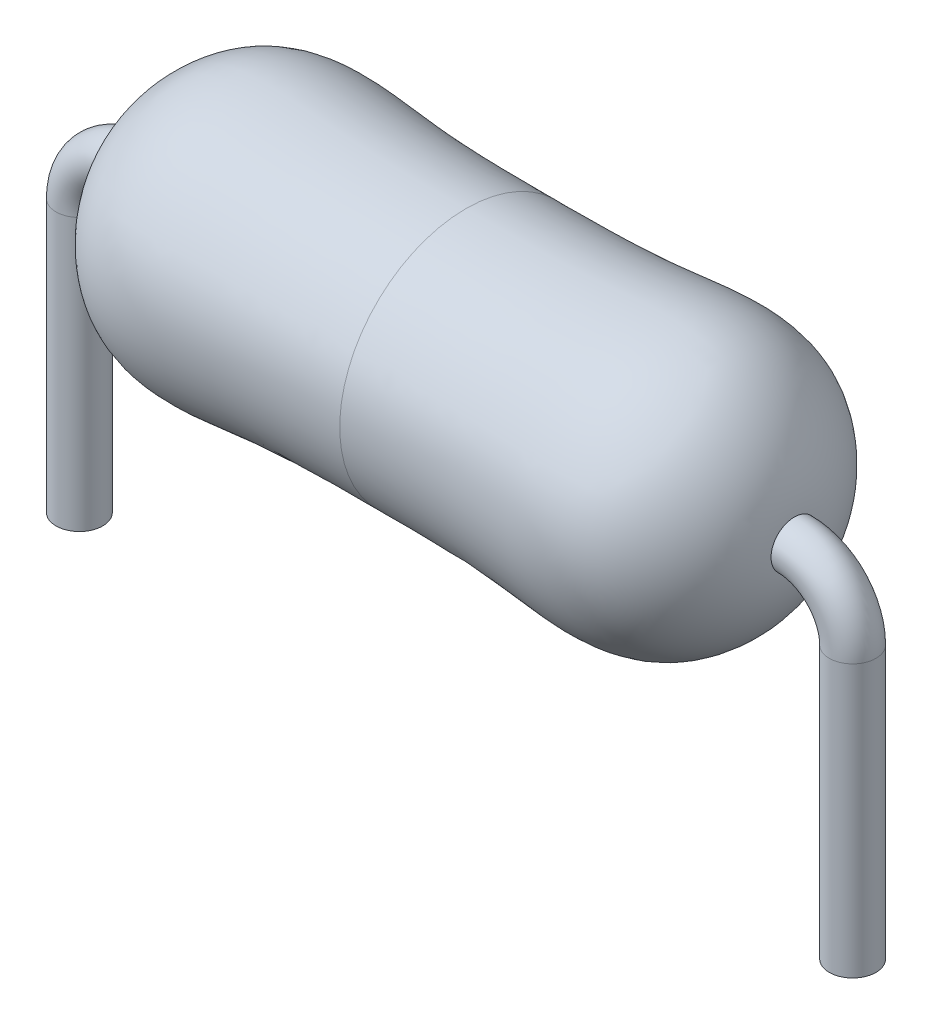
ISO-10303-21;
HEADER;
FILE_DESCRIPTION(('STEP AP214'),'2;1');
FILE_NAME('part.step','',(''),(''),'','','');
FILE_SCHEMA(('AUTOMOTIVE_DESIGN { 1 0 10303 214 1 1 1 1 }'));
ENDSEC;
DATA;
#1=APPLICATION_CONTEXT('core data for automotive mechanical design processes');
#2=APPLICATION_PROTOCOL_DEFINITION('international standard','automotive_design',2000,#1);
#3=PRODUCT_CONTEXT('',#1,'mechanical');
#4=PRODUCT('Part','Part','',(#3));
#5=PRODUCT_RELATED_PRODUCT_CATEGORY('part','',(#4));
#6=PRODUCT_DEFINITION_FORMATION('','',#4);
#7=PRODUCT_DEFINITION_CONTEXT('part definition',#1,'design');
#8=PRODUCT_DEFINITION('design','',#6,#7);
#9=PRODUCT_DEFINITION_SHAPE('','',#8);
#10=(LENGTH_UNIT() NAMED_UNIT(*) SI_UNIT(.MILLI.,.METRE.));
#11=(NAMED_UNIT(*) PLANE_ANGLE_UNIT() SI_UNIT($,.RADIAN.));
#12=(NAMED_UNIT(*) SI_UNIT($,.STERADIAN.) SOLID_ANGLE_UNIT());
#13=UNCERTAINTY_MEASURE_WITH_UNIT(LENGTH_MEASURE(1.E-05),#10,'distance_accuracy_value','');
#14=(GEOMETRIC_REPRESENTATION_CONTEXT(3) GLOBAL_UNCERTAINTY_ASSIGNED_CONTEXT((#13)) GLOBAL_UNIT_ASSIGNED_CONTEXT((#10,
#11,#12)) REPRESENTATION_CONTEXT('',''));
#15=CARTESIAN_POINT('',(0.,0.,0.));
#16=DIRECTION('',(0.,0.,1.));
#17=DIRECTION('',(1.,0.,0.));
#18=AXIS2_PLACEMENT_3D('',#15,#16,#17);
#19=CARTESIAN_POINT('',(0.762,1.016,0.));
#20=DIRECTION('',(0.,0.,-1.));
#21=DIRECTION('',(-1.,0.,0.));
#22=AXIS2_PLACEMENT_3D('',#19,#20,#21);
#23=TOROIDAL_SURFACE('',#22,0.762,0.3048);
#24=CARTESIAN_POINT('',(0.,1.016,0.));
#25=DIRECTION('',(0.,1.,0.));
#26=DIRECTION('',(0.,0.,1.));
#27=AXIS2_PLACEMENT_3D('',#24,#25,#26);
#28=CIRCLE('',#27,0.3048);
#29=CARTESIAN_POINT('',(-0.3048,1.016,0.));
#30=VERTEX_POINT('',#29);
#31=EDGE_CURVE('E39',#30,#30,#28,.T.);
#32=CARTESIAN_POINT('',(0.762,1.778,0.));
#33=DIRECTION('',(1.,0.,0.));
#34=DIRECTION('',(0.,0.,1.));
#35=AXIS2_PLACEMENT_3D('',#32,#33,#34);
#36=CIRCLE('',#35,0.3048);
#37=CARTESIAN_POINT('',(0.762,2.0828,0.));
#38=VERTEX_POINT('',#37);
#39=EDGE_CURVE('E10',#38,#38,#36,.T.);
#40=CARTESIAN_POINT('',(0.762,1.016,0.));
#41=DIRECTION('',(0.,0.,-1.));
#42=DIRECTION('',(-1.,0.,0.));
#43=AXIS2_PLACEMENT_3D('',#40,#41,#42);
#44=CIRCLE('',#43,1.0668);
#45=EDGE_CURVE('',#30,#38,#44,.T.);
#46=ORIENTED_EDGE('',*,*,#31,.T.);
#47=ORIENTED_EDGE('',*,*,#39,.F.);
#48=ORIENTED_EDGE('',*,*,#45,.T.);
#49=ORIENTED_EDGE('',*,*,#45,.F.);
#50=EDGE_LOOP('',(#46,#48,#47,#49));
#51=FACE_BOUND('',#50,.T.);
#52=ADVANCED_FACE('F33',(#51),#23,.T.);
#53=CARTESIAN_POINT('',(0.,1.016,0.));
#54=DIRECTION('',(0.,-1.,0.));
#55=DIRECTION('',(0.,0.,-1.));
#56=AXIS2_PLACEMENT_3D('',#53,#54,#55);
#57=CYLINDRICAL_SURFACE('',#56,0.3048);
#58=ORIENTED_EDGE('',*,*,#31,.F.);
#59=EDGE_LOOP('',(#58));
#60=FACE_BOUND('',#59,.T.);
#61=CARTESIAN_POINT('',(0.,-2.54,0.));
#62=DIRECTION('',(0.,1.,0.));
#63=DIRECTION('',(0.,0.,1.));
#64=AXIS2_PLACEMENT_3D('',#61,#62,#63);
#65=CIRCLE('',#64,0.3048);
#66=CARTESIAN_POINT('',(0.,-2.54,0.3048));
#67=VERTEX_POINT('',#66);
#68=EDGE_CURVE('E43',#67,#67,#65,.T.);
#69=ORIENTED_EDGE('',*,*,#68,.T.);
#70=EDGE_LOOP('',(#69));
#71=FACE_BOUND('',#70,.T.);
#72=ADVANCED_FACE('F67',(#60,#71),#57,.T.);
#73=CARTESIAN_POINT('',(0.,-2.54,0.));
#74=DIRECTION('',(0.,1.,0.));
#75=DIRECTION('',(0.,0.,1.));
#76=AXIS2_PLACEMENT_3D('',#73,#74,#75);
#77=PLANE('',#76);
#78=ORIENTED_EDGE('',*,*,#68,.F.);
#79=EDGE_LOOP('',(#78));
#80=FACE_BOUND('',#79,.T.);
#81=ADVANCED_FACE('F64',(#80),#77,.F.);
#82=CARTESIAN_POINT('',(0.762,1.778,0.));
#83=CARTESIAN_POINT('',(0.757798481162608,1.8794424331425,0.));
#84=CARTESIAN_POINT('',(0.731939999461414,2.50377553806516,0.));
#85=CARTESIAN_POINT('',(1.58171785802034,3.71232146915156,0.));
#86=CARTESIAN_POINT('',(3.36088257649651,3.42818239547803,0.));
#87=CARTESIAN_POINT('',(4.47917399306202,3.42872222585728,0.));
#88=CARTESIAN_POINT('',(5.0546,3.429,0.));
#89=B_SPLINE_CURVE_WITH_KNOTS('',3,(#82,#83,#84,#85,#86,#87,#88),.UNSPECIFIED.,.F.,.F.,(4,1,1,1,
4),(0.,0.0576904747940552,0.355059240367772,0.668140450217807,1.),.UNSPECIFIED.);
#90=CARTESIAN_POINT('',(0.762,1.778,0.));
#91=DIRECTION('',(-1.,0.,0.));
#92=AXIS1_PLACEMENT('',#90,#91);
#93=SURFACE_OF_REVOLUTION('',#89,#92);
#94=ORIENTED_EDGE('',*,*,#39,.T.);
#95=EDGE_LOOP('',(#94));
#96=FACE_BOUND('',#95,.T.);
#97=CARTESIAN_POINT('',(5.0546,1.778,0.));
#98=DIRECTION('',(-1.,0.,0.));
#99=DIRECTION('',(0.,-1.,0.));
#100=AXIS2_PLACEMENT_3D('',#97,#98,#99);
#101=CIRCLE('',#100,1.651);
#102=CARTESIAN_POINT('',(5.0546,0.127,0.));
#103=VERTEX_POINT('',#102);
#104=EDGE_CURVE('E147',#103,#103,#101,.T.);
#105=ORIENTED_EDGE('',*,*,#104,.T.);
#106=EDGE_LOOP('',(#105));
#107=FACE_BOUND('',#106,.T.);
#108=ADVANCED_FACE('F59',(#96,#107),#93,.F.);
#109=CARTESIAN_POINT('',(9.3472,1.016,0.));
#110=DIRECTION('',(0.,0.,-1.));
#111=DIRECTION('',(1.,0.,0.));
#112=AXIS2_PLACEMENT_3D('',#109,#110,#111);
#113=TOROIDAL_SURFACE('',#112,0.762,0.3048);
#114=CARTESIAN_POINT('',(9.3472,1.778,0.));
#115=DIRECTION('',(1.,0.,0.));
#116=DIRECTION('',(0.,0.,1.));
#117=AXIS2_PLACEMENT_3D('',#114,#115,#116);
#118=CIRCLE('',#117,0.3048);
#119=CARTESIAN_POINT('',(9.3472,2.0828,0.));
#120=VERTEX_POINT('',#119);
#121=EDGE_CURVE('E48',#120,#120,#118,.T.);
#122=CARTESIAN_POINT('',(10.1092,1.016,0.));
#123=DIRECTION('',(0.,-1.,0.));
#124=DIRECTION('',(0.,0.,1.));
#125=AXIS2_PLACEMENT_3D('',#122,#123,#124);
#126=CIRCLE('',#125,0.3048);
#127=CARTESIAN_POINT('',(10.414,1.016,0.));
#128=VERTEX_POINT('',#127);
#129=EDGE_CURVE('E154',#128,#128,#126,.T.);
#130=CARTESIAN_POINT('',(9.3472,1.016,0.));
#131=DIRECTION('',(0.,0.,-1.));
#132=DIRECTION('',(1.,0.,0.));
#133=AXIS2_PLACEMENT_3D('',#130,#131,#132);
#134=CIRCLE('',#133,1.0668);
#135=EDGE_CURVE('',#120,#128,#134,.T.);
#136=ORIENTED_EDGE('',*,*,#121,.T.);
#137=ORIENTED_EDGE('',*,*,#129,.F.);
#138=ORIENTED_EDGE('',*,*,#135,.T.);
#139=ORIENTED_EDGE('',*,*,#135,.F.);
#140=EDGE_LOOP('',(#136,#138,#137,#139));
#141=FACE_BOUND('',#140,.T.);
#142=ADVANCED_FACE('F63',(#141),#113,.T.);
#143=CARTESIAN_POINT('',(10.1092,1.016,0.));
#144=DIRECTION('',(0.,-1.,0.));
#145=DIRECTION('',(0.,0.,-1.));
#146=AXIS2_PLACEMENT_3D('',#143,#144,#145);
#147=CYLINDRICAL_SURFACE('',#146,0.3048);
#148=ORIENTED_EDGE('',*,*,#129,.T.);
#149=EDGE_LOOP('',(#148));
#150=FACE_BOUND('',#149,.T.);
#151=CARTESIAN_POINT('',(10.1092,-2.54,0.));
#152=DIRECTION('',(0.,-1.,0.));
#153=DIRECTION('',(0.,0.,1.));
#154=AXIS2_PLACEMENT_3D('',#151,#152,#153);
#155=CIRCLE('',#154,0.3048);
#156=CARTESIAN_POINT('',(10.1092,-2.54,0.3048));
#157=VERTEX_POINT('',#156);
#158=EDGE_CURVE('E153',#157,#157,#155,.T.);
#159=ORIENTED_EDGE('',*,*,#158,.F.);
#160=EDGE_LOOP('',(#159));
#161=FACE_BOUND('',#160,.T.);
#162=ADVANCED_FACE('F93',(#150,#161),#147,.T.);
#163=CARTESIAN_POINT('',(10.1092,-2.54,0.));
#164=DIRECTION('',(0.,1.,0.));
#165=DIRECTION('',(0.,0.,1.));
#166=AXIS2_PLACEMENT_3D('',#163,#164,#165);
#167=PLANE('',#166);
#168=ORIENTED_EDGE('',*,*,#158,.T.);
#169=EDGE_LOOP('',(#168));
#170=FACE_BOUND('',#169,.T.);
#171=ADVANCED_FACE('F101',(#170),#167,.F.);
#172=CARTESIAN_POINT('',(9.3472,1.778,0.));
#173=CARTESIAN_POINT('',(9.35140151883739,1.8794424331425,0.));
#174=CARTESIAN_POINT('',(9.37726000053859,2.50377553806516,0.));
#175=CARTESIAN_POINT('',(8.52748214197966,3.71232146915156,0.));
#176=CARTESIAN_POINT('',(6.74831742350349,3.42818239547803,0.));
#177=CARTESIAN_POINT('',(5.63002600693798,3.42872222585728,0.));
#178=CARTESIAN_POINT('',(5.0546,3.429,0.));
#179=B_SPLINE_CURVE_WITH_KNOTS('',3,(#172,#173,#174,#175,#176,#177,#178),.UNSPECIFIED.,.F.,.F.,
(4,1,1,1,4),(0.,0.0576904747940552,0.355059240367772,0.668140450217807,1.),.UNSPECIFIED.);
#180=CARTESIAN_POINT('',(9.3472,1.778,0.));
#181=DIRECTION('',(1.,0.,0.));
#182=AXIS1_PLACEMENT('',#180,#181);
#183=SURFACE_OF_REVOLUTION('',#179,#182);
#184=ORIENTED_EDGE('',*,*,#121,.F.);
#185=EDGE_LOOP('',(#184));
#186=FACE_BOUND('',#185,.T.);
#187=ORIENTED_EDGE('',*,*,#104,.F.);
#188=EDGE_LOOP('',(#187));
#189=FACE_BOUND('',#188,.T.);
#190=ADVANCED_FACE('F109',(#186,#189),#183,.F.);
#191=CLOSED_SHELL('',(#52,#72,#81,#108,#142,#162,#171,#190));
#192=MANIFOLD_SOLID_BREP('B2',#191);
#193=ADVANCED_BREP_SHAPE_REPRESENTATION('',(#18,#192),#14);
#194=SHAPE_DEFINITION_REPRESENTATION(#9,#193);
ENDSEC;
END-ISO-10303-21;
